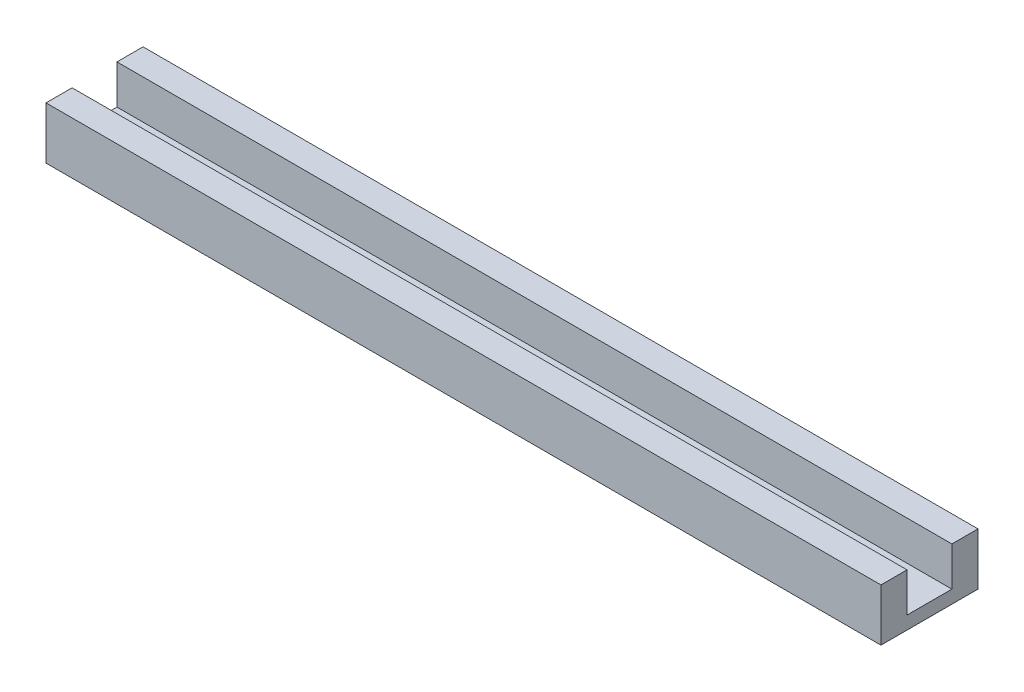
ISO-10303-21;
HEADER;
FILE_DESCRIPTION(('STEP AP214'),'2;1');
FILE_NAME('part.step','',(''),(''),'','','');
FILE_SCHEMA(('AUTOMOTIVE_DESIGN { 1 0 10303 214 1 1 1 1 }'));
ENDSEC;
DATA;
#1=APPLICATION_CONTEXT('core data for automotive mechanical design processes');
#2=APPLICATION_PROTOCOL_DEFINITION('international standard','automotive_design',2000,#1);
#3=PRODUCT_CONTEXT('',#1,'mechanical');
#4=PRODUCT('Part','Part','',(#3));
#5=PRODUCT_RELATED_PRODUCT_CATEGORY('part','',(#4));
#6=PRODUCT_DEFINITION_FORMATION('','',#4);
#7=PRODUCT_DEFINITION_CONTEXT('part definition',#1,'design');
#8=PRODUCT_DEFINITION('design','',#6,#7);
#9=PRODUCT_DEFINITION_SHAPE('','',#8);
#10=(LENGTH_UNIT() NAMED_UNIT(*) SI_UNIT(.MILLI.,.METRE.));
#11=(NAMED_UNIT(*) PLANE_ANGLE_UNIT() SI_UNIT($,.RADIAN.));
#12=(NAMED_UNIT(*) SI_UNIT($,.STERADIAN.) SOLID_ANGLE_UNIT());
#13=UNCERTAINTY_MEASURE_WITH_UNIT(LENGTH_MEASURE(1.E-05),#10,'distance_accuracy_value','');
#14=(GEOMETRIC_REPRESENTATION_CONTEXT(3) GLOBAL_UNCERTAINTY_ASSIGNED_CONTEXT((#13)) GLOBAL_UNIT_ASSIGNED_CONTEXT((#10,
#11,#12)) REPRESENTATION_CONTEXT('',''));
#15=CARTESIAN_POINT('',(0.,0.,0.));
#16=DIRECTION('',(0.,0.,1.));
#17=DIRECTION('',(1.,0.,0.));
#18=AXIS2_PLACEMENT_3D('',#15,#16,#17);
#19=CARTESIAN_POINT('',(0.,3.175,0.));
#20=DIRECTION('',(0.,1.,0.));
#21=DIRECTION('',(0.,0.,1.));
#22=AXIS2_PLACEMENT_3D('',#19,#20,#21);
#23=PLANE('',#22);
#24=DIRECTION('',(0.,0.,1.));
#25=VECTOR('',#24,1.);
#26=CARTESIAN_POINT('',(-15.7346513597572,3.175,-12.6633402061856));
#27=LINE('',#26,#25);
#28=CARTESIAN_POINT('',(-15.7346513597572,3.175,-6.31334020618557));
#29=VERTEX_POINT('',#28);
#30=CARTESIAN_POINT('',(-15.7346513597572,3.175,4.60865979381445));
#31=VERTEX_POINT('',#30);
#32=EDGE_CURVE('E60',#29,#31,#27,.T.);
#33=ORIENTED_EDGE('',*,*,#32,.T.);
#34=DIRECTION('',(-1.,0.,0.));
#35=VECTOR('',#34,1.);
#36=CARTESIAN_POINT('',(187.465348640243,3.175,4.60865979381443));
#37=LINE('',#36,#35);
#38=CARTESIAN_POINT('',(187.465348640243,3.175,4.60865979381444));
#39=VERTEX_POINT('',#38);
#40=EDGE_CURVE('E55',#39,#31,#37,.T.);
#41=ORIENTED_EDGE('',*,*,#40,.F.);
#42=DIRECTION('',(0.,0.,-1.));
#43=VECTOR('',#42,1.);
#44=CARTESIAN_POINT('',(187.465348640243,3.175,-12.6633402061856));
#45=LINE('',#44,#43);
#46=CARTESIAN_POINT('',(187.465348640243,3.175,-6.31334020618557));
#47=VERTEX_POINT('',#46);
#48=EDGE_CURVE('E128',#39,#47,#45,.T.);
#49=ORIENTED_EDGE('',*,*,#48,.T.);
#50=DIRECTION('',(1.,0.,0.));
#51=VECTOR('',#50,1.);
#52=CARTESIAN_POINT('',(-15.7346513597572,3.175,-6.31334020618557));
#53=LINE('',#52,#51);
#54=EDGE_CURVE('E130',#29,#47,#53,.T.);
#55=ORIENTED_EDGE('',*,*,#54,.F.);
#56=EDGE_LOOP('',(#33,#41,#49,#55));
#57=FACE_BOUND('',#56,.T.);
#58=ADVANCED_FACE('F39',(#57),#23,.T.);
#59=CARTESIAN_POINT('',(-15.7346513597572,3.175,-12.6633402061856));
#60=DIRECTION('',(1.,0.,0.));
#61=DIRECTION('',(0.,0.,-1.));
#62=AXIS2_PLACEMENT_3D('',#59,#60,#61);
#63=PLANE('',#62);
#64=DIRECTION('',(0.,0.,1.));
#65=VECTOR('',#64,1.);
#66=CARTESIAN_POINT('',(-15.7346513597572,0.,-12.6633402061856));
#67=LINE('',#66,#65);
#68=CARTESIAN_POINT('',(-15.7346513597572,0.,-12.6633402061856));
#69=VERTEX_POINT('',#68);
#70=CARTESIAN_POINT('',(-15.7346513597572,0.,10.9586597938144));
#71=VERTEX_POINT('',#70);
#72=EDGE_CURVE('E161',#69,#71,#67,.T.);
#73=ORIENTED_EDGE('',*,*,#72,.T.);
#74=DIRECTION('',(0.,-1.,0.));
#75=VECTOR('',#74,1.);
#76=CARTESIAN_POINT('',(-15.7346513597572,3.175,10.9586597938144));
#77=LINE('',#76,#75);
#78=CARTESIAN_POINT('',(-15.7346513597572,12.7,10.9586597938144));
#79=VERTEX_POINT('',#78);
#80=EDGE_CURVE('E11',#79,#71,#77,.T.);
#81=ORIENTED_EDGE('',*,*,#80,.F.);
#82=DIRECTION('',(0.,0.,1.));
#83=VECTOR('',#82,1.);
#84=CARTESIAN_POINT('',(-15.7346513597572,12.7,10.9586597938144));
#85=LINE('',#84,#83);
#86=CARTESIAN_POINT('',(-15.7346513597572,12.7,4.60865979381445));
#87=VERTEX_POINT('',#86);
#88=EDGE_CURVE('E114',#87,#79,#85,.T.);
#89=ORIENTED_EDGE('',*,*,#88,.F.);
#90=DIRECTION('',(0.,-1.,0.));
#91=VECTOR('',#90,1.);
#92=CARTESIAN_POINT('',(-15.7346513597572,12.7,4.60865979381445));
#93=LINE('',#92,#91);
#94=EDGE_CURVE('E109',#87,#31,#93,.T.);
#95=ORIENTED_EDGE('',*,*,#94,.T.);
#96=ORIENTED_EDGE('',*,*,#32,.F.);
#97=DIRECTION('',(0.,-1.,0.));
#98=VECTOR('',#97,1.);
#99=CARTESIAN_POINT('',(-15.7346513597572,12.7,-6.31334020618557));
#100=LINE('',#99,#98);
#101=CARTESIAN_POINT('',(-15.7346513597572,12.7,-6.31334020618557));
#102=VERTEX_POINT('',#101);
#103=EDGE_CURVE('E157',#102,#29,#100,.T.);
#104=ORIENTED_EDGE('',*,*,#103,.F.);
#105=DIRECTION('',(0.,0.,1.));
#106=VECTOR('',#105,1.);
#107=CARTESIAN_POINT('',(-15.7346513597572,12.7,-12.6633402061856));
#108=LINE('',#107,#106);
#109=CARTESIAN_POINT('',(-15.7346513597572,12.7,-12.6633402061856));
#110=VERTEX_POINT('',#109);
#111=EDGE_CURVE('E135',#110,#102,#108,.T.);
#112=ORIENTED_EDGE('',*,*,#111,.F.);
#113=DIRECTION('',(0.,-1.,0.));
#114=VECTOR('',#113,1.);
#115=CARTESIAN_POINT('',(-15.7346513597572,3.175,-12.6633402061856));
#116=LINE('',#115,#114);
#117=EDGE_CURVE('E167',#110,#69,#116,.T.);
#118=ORIENTED_EDGE('',*,*,#117,.T.);
#119=EDGE_LOOP('',(#73,#81,#89,#95,#96,#104,#112,#118));
#120=FACE_BOUND('',#119,.T.);
#121=ADVANCED_FACE('F41',(#120),#63,.F.);
#122=CARTESIAN_POINT('',(-15.7346513597572,3.175,10.9586597938144));
#123=DIRECTION('',(0.,0.,-1.));
#124=DIRECTION('',(-1.,0.,0.));
#125=AXIS2_PLACEMENT_3D('',#122,#123,#124);
#126=PLANE('',#125);
#127=DIRECTION('',(1.,0.,0.));
#128=VECTOR('',#127,1.);
#129=CARTESIAN_POINT('',(-15.7346513597572,0.,10.9586597938144));
#130=LINE('',#129,#128);
#131=CARTESIAN_POINT('',(187.465348640243,0.,10.9586597938144));
#132=VERTEX_POINT('',#131);
#133=EDGE_CURVE('E171',#71,#132,#130,.T.);
#134=ORIENTED_EDGE('',*,*,#133,.T.);
#135=DIRECTION('',(0.,-1.,0.));
#136=VECTOR('',#135,1.);
#137=CARTESIAN_POINT('',(187.465348640243,3.175,10.9586597938144));
#138=LINE('',#137,#136);
#139=CARTESIAN_POINT('',(187.465348640243,12.7,10.9586597938144));
#140=VERTEX_POINT('',#139);
#141=EDGE_CURVE('E48',#140,#132,#138,.T.);
#142=ORIENTED_EDGE('',*,*,#141,.F.);
#143=DIRECTION('',(1.,0.,0.));
#144=VECTOR('',#143,1.);
#145=CARTESIAN_POINT('',(187.465348640243,12.7,10.9586597938144));
#146=LINE('',#145,#144);
#147=EDGE_CURVE('E121',#79,#140,#146,.T.);
#148=ORIENTED_EDGE('',*,*,#147,.F.);
#149=ORIENTED_EDGE('',*,*,#80,.T.);
#150=EDGE_LOOP('',(#134,#142,#148,#149));
#151=FACE_BOUND('',#150,.T.);
#152=ADVANCED_FACE('F209',(#151),#126,.F.);
#153=CARTESIAN_POINT('',(187.465348640243,3.175,-12.6633402061856));
#154=DIRECTION('',(-1.,0.,0.));
#155=DIRECTION('',(0.,0.,1.));
#156=AXIS2_PLACEMENT_3D('',#153,#154,#155);
#157=PLANE('',#156);
#158=DIRECTION('',(0.,0.,-1.));
#159=VECTOR('',#158,1.);
#160=CARTESIAN_POINT('',(187.465348640243,0.,-12.6633402061856));
#161=LINE('',#160,#159);
#162=CARTESIAN_POINT('',(187.465348640243,0.,-12.6633402061856));
#163=VERTEX_POINT('',#162);
#164=EDGE_CURVE('E174',#132,#163,#161,.T.);
#165=ORIENTED_EDGE('',*,*,#164,.T.);
#166=DIRECTION('',(0.,-1.,0.));
#167=VECTOR('',#166,1.);
#168=CARTESIAN_POINT('',(187.465348640243,3.175,-12.6633402061856));
#169=LINE('',#168,#167);
#170=CARTESIAN_POINT('',(187.465348640243,12.7,-12.6633402061856));
#171=VERTEX_POINT('',#170);
#172=EDGE_CURVE('E182',#171,#163,#169,.T.);
#173=ORIENTED_EDGE('',*,*,#172,.F.);
#174=DIRECTION('',(0.,0.,-1.));
#175=VECTOR('',#174,1.);
#176=CARTESIAN_POINT('',(187.465348640243,12.7,-12.6633402061856));
#177=LINE('',#176,#175);
#178=CARTESIAN_POINT('',(187.465348640243,12.7,-6.31334020618557));
#179=VERTEX_POINT('',#178);
#180=EDGE_CURVE('E146',#179,#171,#177,.T.);
#181=ORIENTED_EDGE('',*,*,#180,.F.);
#182=DIRECTION('',(0.,-1.,0.));
#183=VECTOR('',#182,1.);
#184=CARTESIAN_POINT('',(187.465348640243,12.7,-6.31334020618557));
#185=LINE('',#184,#183);
#186=EDGE_CURVE('E153',#179,#47,#185,.T.);
#187=ORIENTED_EDGE('',*,*,#186,.T.);
#188=ORIENTED_EDGE('',*,*,#48,.F.);
#189=DIRECTION('',(0.,-1.,0.));
#190=VECTOR('',#189,1.);
#191=CARTESIAN_POINT('',(187.465348640243,12.7,4.60865979381443));
#192=LINE('',#191,#190);
#193=CARTESIAN_POINT('',(187.465348640243,12.7,4.60865979381443));
#194=VERTEX_POINT('',#193);
#195=EDGE_CURVE('E107',#194,#39,#192,.T.);
#196=ORIENTED_EDGE('',*,*,#195,.F.);
#197=DIRECTION('',(0.,0.,-1.));
#198=VECTOR('',#197,1.);
#199=CARTESIAN_POINT('',(187.465348640243,12.7,10.9586597938144));
#200=LINE('',#199,#198);
#201=EDGE_CURVE('E115',#140,#194,#200,.T.);
#202=ORIENTED_EDGE('',*,*,#201,.F.);
#203=ORIENTED_EDGE('',*,*,#141,.T.);
#204=EDGE_LOOP('',(#165,#173,#181,#187,#188,#196,#202,#203));
#205=FACE_BOUND('',#204,.T.);
#206=ADVANCED_FACE('F126',(#205),#157,.F.);
#207=CARTESIAN_POINT('',(-15.7346513597572,3.175,-12.6633402061856));
#208=DIRECTION('',(0.,0.,1.));
#209=DIRECTION('',(1.,0.,0.));
#210=AXIS2_PLACEMENT_3D('',#207,#208,#209);
#211=PLANE('',#210);
#212=DIRECTION('',(-1.,0.,0.));
#213=VECTOR('',#212,1.);
#214=CARTESIAN_POINT('',(-15.7346513597572,0.,-12.6633402061856));
#215=LINE('',#214,#213);
#216=EDGE_CURVE('E164',#163,#69,#215,.T.);
#217=ORIENTED_EDGE('',*,*,#216,.T.);
#218=ORIENTED_EDGE('',*,*,#117,.F.);
#219=DIRECTION('',(-1.,0.,0.));
#220=VECTOR('',#219,1.);
#221=CARTESIAN_POINT('',(-15.7346513597572,12.7,-12.6633402061856));
#222=LINE('',#221,#220);
#223=EDGE_CURVE('E150',#171,#110,#222,.T.);
#224=ORIENTED_EDGE('',*,*,#223,.F.);
#225=ORIENTED_EDGE('',*,*,#172,.T.);
#226=EDGE_LOOP('',(#217,#218,#224,#225));
#227=FACE_BOUND('',#226,.T.);
#228=ADVANCED_FACE('F193',(#227),#211,.F.);
#229=CARTESIAN_POINT('',(0.,0.,0.));
#230=DIRECTION('',(0.,1.,0.));
#231=DIRECTION('',(0.,0.,1.));
#232=AXIS2_PLACEMENT_3D('',#229,#230,#231);
#233=PLANE('',#232);
#234=ORIENTED_EDGE('',*,*,#72,.F.);
#235=ORIENTED_EDGE('',*,*,#216,.F.);
#236=ORIENTED_EDGE('',*,*,#164,.F.);
#237=ORIENTED_EDGE('',*,*,#133,.F.);
#238=EDGE_LOOP('',(#234,#235,#236,#237));
#239=FACE_BOUND('',#238,.T.);
#240=ADVANCED_FACE('F191',(#239),#233,.F.);
#241=CARTESIAN_POINT('',(-15.7346513597572,12.7,-6.31334020618557));
#242=DIRECTION('',(0.,0.,-1.));
#243=DIRECTION('',(-1.,0.,0.));
#244=AXIS2_PLACEMENT_3D('',#241,#242,#243);
#245=PLANE('',#244);
#246=ORIENTED_EDGE('',*,*,#54,.T.);
#247=ORIENTED_EDGE('',*,*,#186,.F.);
#248=DIRECTION('',(1.,0.,0.));
#249=VECTOR('',#248,1.);
#250=CARTESIAN_POINT('',(-15.7346513597572,12.7,-6.31334020618557));
#251=LINE('',#250,#249);
#252=EDGE_CURVE('E143',#102,#179,#251,.T.);
#253=ORIENTED_EDGE('',*,*,#252,.F.);
#254=ORIENTED_EDGE('',*,*,#103,.T.);
#255=EDGE_LOOP('',(#246,#247,#253,#254));
#256=FACE_BOUND('',#255,.T.);
#257=ADVANCED_FACE('F203',(#256),#245,.F.);
#258=CARTESIAN_POINT('',(0.,12.7,0.));
#259=DIRECTION('',(0.,1.,0.));
#260=DIRECTION('',(0.,0.,1.));
#261=AXIS2_PLACEMENT_3D('',#258,#259,#260);
#262=PLANE('',#261);
#263=ORIENTED_EDGE('',*,*,#111,.T.);
#264=ORIENTED_EDGE('',*,*,#252,.T.);
#265=ORIENTED_EDGE('',*,*,#180,.T.);
#266=ORIENTED_EDGE('',*,*,#223,.T.);
#267=EDGE_LOOP('',(#263,#264,#265,#266));
#268=FACE_BOUND('',#267,.T.);
#269=ADVANCED_FACE('F199',(#268),#262,.T.);
#270=CARTESIAN_POINT('',(187.465348640243,12.7,4.60865979381443));
#271=DIRECTION('',(0.,0.,1.));
#272=DIRECTION('',(1.,0.,0.));
#273=AXIS2_PLACEMENT_3D('',#270,#271,#272);
#274=PLANE('',#273);
#275=ORIENTED_EDGE('',*,*,#40,.T.);
#276=ORIENTED_EDGE('',*,*,#94,.F.);
#277=DIRECTION('',(-1.,0.,0.));
#278=VECTOR('',#277,1.);
#279=CARTESIAN_POINT('',(187.465348640243,12.7,4.60865979381443));
#280=LINE('',#279,#278);
#281=EDGE_CURVE('E103',#194,#87,#280,.T.);
#282=ORIENTED_EDGE('',*,*,#281,.F.);
#283=ORIENTED_EDGE('',*,*,#195,.T.);
#284=EDGE_LOOP('',(#275,#276,#282,#283));
#285=FACE_BOUND('',#284,.T.);
#286=ADVANCED_FACE('F105',(#285),#274,.F.);
#287=CARTESIAN_POINT('',(0.,12.7,0.));
#288=DIRECTION('',(0.,1.,0.));
#289=DIRECTION('',(0.,0.,1.));
#290=AXIS2_PLACEMENT_3D('',#287,#288,#289);
#291=PLANE('',#290);
#292=ORIENTED_EDGE('',*,*,#201,.T.);
#293=ORIENTED_EDGE('',*,*,#281,.T.);
#294=ORIENTED_EDGE('',*,*,#88,.T.);
#295=ORIENTED_EDGE('',*,*,#147,.T.);
#296=EDGE_LOOP('',(#292,#293,#294,#295));
#297=FACE_BOUND('',#296,.T.);
#298=ADVANCED_FACE('F119',(#297),#291,.T.);
#299=CLOSED_SHELL('',(#58,#121,#152,#206,#228,#240,#257,#269,#286,#298));
#300=MANIFOLD_SOLID_BREP('B2',#299);
#301=ADVANCED_BREP_SHAPE_REPRESENTATION('',(#18,#300),#14);
#302=SHAPE_DEFINITION_REPRESENTATION(#9,#301);
ENDSEC;
END-ISO-10303-21;
